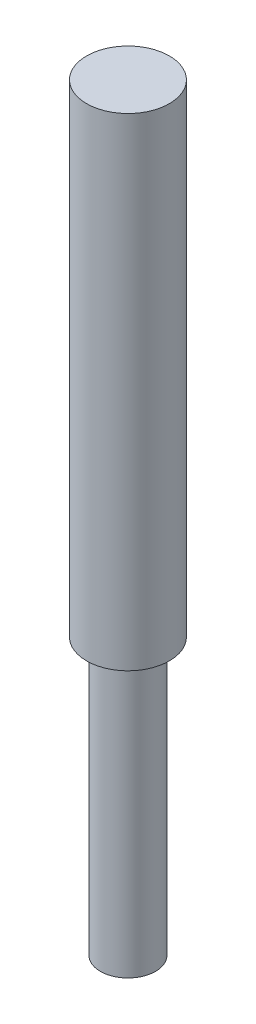
ISO-10303-21;
HEADER;
FILE_DESCRIPTION(('STEP AP214'),'2;1');
FILE_NAME('part.step','',(''),(''),'','','');
FILE_SCHEMA(('AUTOMOTIVE_DESIGN { 1 0 10303 214 1 1 1 1 }'));
ENDSEC;
DATA;
#1=APPLICATION_CONTEXT('core data for automotive mechanical design processes');
#2=APPLICATION_PROTOCOL_DEFINITION('international standard','automotive_design',2000,#1);
#3=PRODUCT_CONTEXT('',#1,'mechanical');
#4=PRODUCT('Part','Part','',(#3));
#5=PRODUCT_RELATED_PRODUCT_CATEGORY('part','',(#4));
#6=PRODUCT_DEFINITION_FORMATION('','',#4);
#7=PRODUCT_DEFINITION_CONTEXT('part definition',#1,'design');
#8=PRODUCT_DEFINITION('design','',#6,#7);
#9=PRODUCT_DEFINITION_SHAPE('','',#8);
#10=(LENGTH_UNIT() NAMED_UNIT(*) SI_UNIT(.MILLI.,.METRE.));
#11=(NAMED_UNIT(*) PLANE_ANGLE_UNIT() SI_UNIT($,.RADIAN.));
#12=(NAMED_UNIT(*) SI_UNIT($,.STERADIAN.) SOLID_ANGLE_UNIT());
#13=UNCERTAINTY_MEASURE_WITH_UNIT(LENGTH_MEASURE(1.E-05),#10,'distance_accuracy_value','');
#14=(GEOMETRIC_REPRESENTATION_CONTEXT(3) GLOBAL_UNCERTAINTY_ASSIGNED_CONTEXT((#13)) GLOBAL_UNIT_ASSIGNED_CONTEXT((#10,
#11,#12)) REPRESENTATION_CONTEXT('',''));
#15=CARTESIAN_POINT('',(0.,0.,0.));
#16=DIRECTION('',(0.,0.,1.));
#17=DIRECTION('',(1.,0.,0.));
#18=AXIS2_PLACEMENT_3D('',#15,#16,#17);
#19=CARTESIAN_POINT('',(0.,35.,0.));
#20=DIRECTION('',(0.,-1.,0.));
#21=DIRECTION('',(0.,0.,-1.));
#22=AXIS2_PLACEMENT_3D('',#19,#20,#21);
#23=CYLINDRICAL_SURFACE('',#22,3.);
#24=CARTESIAN_POINT('',(0.,35.,0.));
#25=DIRECTION('',(0.,1.,0.));
#26=DIRECTION('',(0.,0.,1.));
#27=AXIS2_PLACEMENT_3D('',#24,#25,#26);
#28=CIRCLE('',#27,3.);
#29=CARTESIAN_POINT('',(0.,35.,3.));
#30=VERTEX_POINT('',#29);
#31=EDGE_CURVE('E11',#30,#30,#28,.T.);
#32=ORIENTED_EDGE('',*,*,#31,.F.);
#33=EDGE_LOOP('',(#32));
#34=FACE_BOUND('',#33,.T.);
#35=CARTESIAN_POINT('',(0.,0.,0.));
#36=DIRECTION('',(0.,1.,0.));
#37=DIRECTION('',(0.,0.,1.));
#38=AXIS2_PLACEMENT_3D('',#35,#36,#37);
#39=CIRCLE('',#38,3.);
#40=CARTESIAN_POINT('',(0.,0.,3.));
#41=VERTEX_POINT('',#40);
#42=EDGE_CURVE('E60',#41,#41,#39,.T.);
#43=ORIENTED_EDGE('',*,*,#42,.T.);
#44=EDGE_LOOP('',(#43));
#45=FACE_BOUND('',#44,.T.);
#46=ADVANCED_FACE('F57',(#34,#45),#23,.T.);
#47=CARTESIAN_POINT('',(0.,0.,0.));
#48=DIRECTION('',(0.,1.,0.));
#49=DIRECTION('',(0.,0.,1.));
#50=AXIS2_PLACEMENT_3D('',#47,#48,#49);
#51=PLANE('',#50);
#52=CARTESIAN_POINT('',(0.,0.,0.));
#53=DIRECTION('',(0.,1.,0.));
#54=DIRECTION('',(0.,0.,1.));
#55=AXIS2_PLACEMENT_3D('',#52,#53,#54);
#56=CIRCLE('',#55,2.);
#57=CARTESIAN_POINT('',(0.,0.,2.));
#58=VERTEX_POINT('',#57);
#59=EDGE_CURVE('E69',#58,#58,#56,.T.);
#60=ORIENTED_EDGE('',*,*,#59,.T.);
#61=EDGE_LOOP('',(#60));
#62=FACE_BOUND('',#61,.T.);
#63=ORIENTED_EDGE('',*,*,#42,.F.);
#64=EDGE_LOOP('',(#63));
#65=FACE_BOUND('',#64,.T.);
#66=ADVANCED_FACE('F87',(#62,#65),#51,.F.);
#67=CARTESIAN_POINT('',(0.,35.,0.));
#68=DIRECTION('',(0.,1.,0.));
#69=DIRECTION('',(0.,0.,1.));
#70=AXIS2_PLACEMENT_3D('',#67,#68,#69);
#71=PLANE('',#70);
#72=ORIENTED_EDGE('',*,*,#31,.T.);
#73=EDGE_LOOP('',(#72));
#74=FACE_BOUND('',#73,.T.);
#75=ADVANCED_FACE('F84',(#74),#71,.T.);
#76=CARTESIAN_POINT('',(0.,-20.,0.));
#77=DIRECTION('',(0.,1.,0.));
#78=DIRECTION('',(0.,0.,1.));
#79=AXIS2_PLACEMENT_3D('',#76,#77,#78);
#80=CYLINDRICAL_SURFACE('',#79,2.);
#81=CARTESIAN_POINT('',(0.,-20.,0.));
#82=DIRECTION('',(0.,1.,0.));
#83=DIRECTION('',(0.,0.,1.));
#84=AXIS2_PLACEMENT_3D('',#81,#82,#83);
#85=CIRCLE('',#84,2.);
#86=CARTESIAN_POINT('',(0.,-20.,2.));
#87=VERTEX_POINT('',#86);
#88=EDGE_CURVE('E67',#87,#87,#85,.T.);
#89=ORIENTED_EDGE('',*,*,#88,.T.);
#90=EDGE_LOOP('',(#89));
#91=FACE_BOUND('',#90,.T.);
#92=ORIENTED_EDGE('',*,*,#59,.F.);
#93=EDGE_LOOP('',(#92));
#94=FACE_BOUND('',#93,.T.);
#95=ADVANCED_FACE('F75',(#91,#94),#80,.T.);
#96=CARTESIAN_POINT('',(0.,-20.,0.));
#97=DIRECTION('',(0.,1.,0.));
#98=DIRECTION('',(0.,0.,1.));
#99=AXIS2_PLACEMENT_3D('',#96,#97,#98);
#100=PLANE('',#99);
#101=ORIENTED_EDGE('',*,*,#88,.F.);
#102=EDGE_LOOP('',(#101));
#103=FACE_BOUND('',#102,.T.);
#104=ADVANCED_FACE('F78',(#103),#100,.F.);
#105=CLOSED_SHELL('',(#46,#66,#75,#95,#104));
#106=MANIFOLD_SOLID_BREP('B2',#105);
#107=ADVANCED_BREP_SHAPE_REPRESENTATION('',(#18,#106),#14);
#108=SHAPE_DEFINITION_REPRESENTATION(#9,#107);
ENDSEC;
END-ISO-10303-21;
